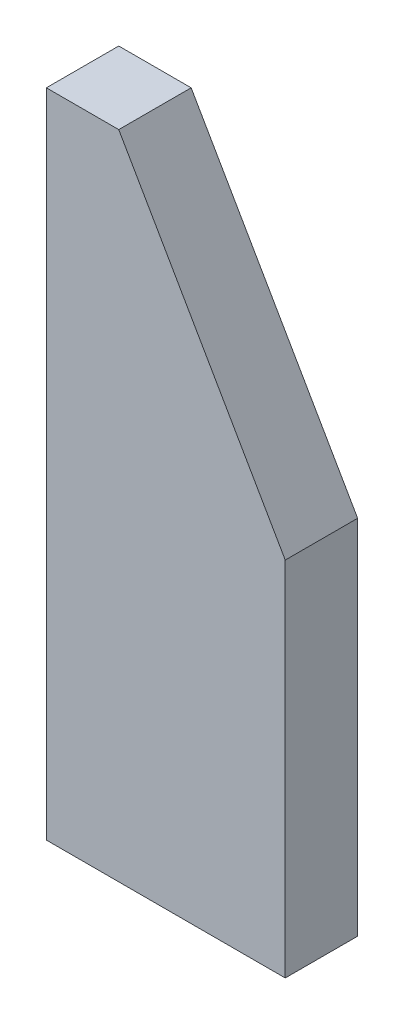
ISO-10303-21;
HEADER;
FILE_DESCRIPTION(('STEP AP214'),'2;1');
FILE_NAME('part.step','',(''),(''),'','','');
FILE_SCHEMA(('AUTOMOTIVE_DESIGN { 1 0 10303 214 1 1 1 1 }'));
ENDSEC;
DATA;
#1=APPLICATION_CONTEXT('core data for automotive mechanical design processes');
#2=APPLICATION_PROTOCOL_DEFINITION('international standard','automotive_design',2000,#1);
#3=PRODUCT_CONTEXT('',#1,'mechanical');
#4=PRODUCT('Part','Part','',(#3));
#5=PRODUCT_RELATED_PRODUCT_CATEGORY('part','',(#4));
#6=PRODUCT_DEFINITION_FORMATION('','',#4);
#7=PRODUCT_DEFINITION_CONTEXT('part definition',#1,'design');
#8=PRODUCT_DEFINITION('design','',#6,#7);
#9=PRODUCT_DEFINITION_SHAPE('','',#8);
#10=(LENGTH_UNIT() NAMED_UNIT(*) SI_UNIT(.MILLI.,.METRE.));
#11=(NAMED_UNIT(*) PLANE_ANGLE_UNIT() SI_UNIT($,.RADIAN.));
#12=(NAMED_UNIT(*) SI_UNIT($,.STERADIAN.) SOLID_ANGLE_UNIT());
#13=UNCERTAINTY_MEASURE_WITH_UNIT(LENGTH_MEASURE(1.E-05),#10,'distance_accuracy_value','');
#14=(GEOMETRIC_REPRESENTATION_CONTEXT(3) GLOBAL_UNCERTAINTY_ASSIGNED_CONTEXT((#13)) GLOBAL_UNIT_ASSIGNED_CONTEXT((#10,
#11,#12)) REPRESENTATION_CONTEXT('',''));
#15=CARTESIAN_POINT('',(0.,0.,0.));
#16=DIRECTION('',(0.,0.,1.));
#17=DIRECTION('',(1.,0.,0.));
#18=AXIS2_PLACEMENT_3D('',#15,#16,#17);
#19=CARTESIAN_POINT('',(0.,180.,20.));
#20=DIRECTION('',(1.,0.,0.));
#21=DIRECTION('',(0.,1.,0.));
#22=AXIS2_PLACEMENT_3D('',#19,#20,#21);
#23=PLANE('',#22);
#24=DIRECTION('',(0.,-1.,0.));
#25=VECTOR('',#24,1.);
#26=CARTESIAN_POINT('',(0.,180.,0.));
#27=LINE('',#26,#25);
#28=CARTESIAN_POINT('',(0.,180.,0.));
#29=VERTEX_POINT('',#28);
#30=CARTESIAN_POINT('',(0.,0.,0.));
#31=VERTEX_POINT('',#30);
#32=EDGE_CURVE('E109',#29,#31,#27,.T.);
#33=ORIENTED_EDGE('',*,*,#32,.T.);
#34=DIRECTION('',(0.,0.,-1.));
#35=VECTOR('',#34,1.);
#36=CARTESIAN_POINT('',(0.,0.,20.));
#37=LINE('',#36,#35);
#38=CARTESIAN_POINT('',(0.,0.,20.));
#39=VERTEX_POINT('',#38);
#40=EDGE_CURVE('E11',#39,#31,#37,.T.);
#41=ORIENTED_EDGE('',*,*,#40,.F.);
#42=DIRECTION('',(0.,-1.,0.));
#43=VECTOR('',#42,1.);
#44=CARTESIAN_POINT('',(0.,180.,20.));
#45=LINE('',#44,#43);
#46=CARTESIAN_POINT('',(0.,180.,20.));
#47=VERTEX_POINT('',#46);
#48=EDGE_CURVE('E117',#47,#39,#45,.T.);
#49=ORIENTED_EDGE('',*,*,#48,.F.);
#50=DIRECTION('',(0.,0.,-1.));
#51=VECTOR('',#50,1.);
#52=CARTESIAN_POINT('',(0.,180.,20.));
#53=LINE('',#52,#51);
#54=EDGE_CURVE('E105',#47,#29,#53,.T.);
#55=ORIENTED_EDGE('',*,*,#54,.T.);
#56=EDGE_LOOP('',(#33,#41,#49,#55));
#57=FACE_BOUND('',#56,.T.);
#58=ADVANCED_FACE('F35',(#57),#23,.F.);
#59=CARTESIAN_POINT('',(0.,0.,20.));
#60=DIRECTION('',(0.,1.,0.));
#61=DIRECTION('',(0.,0.,1.));
#62=AXIS2_PLACEMENT_3D('',#59,#60,#61);
#63=PLANE('',#62);
#64=DIRECTION('',(1.,0.,0.));
#65=VECTOR('',#64,1.);
#66=CARTESIAN_POINT('',(0.,0.,0.));
#67=LINE('',#66,#65);
#68=CARTESIAN_POINT('',(66.,0.,0.));
#69=VERTEX_POINT('',#68);
#70=EDGE_CURVE('E112',#31,#69,#67,.T.);
#71=ORIENTED_EDGE('',*,*,#70,.T.);
#72=DIRECTION('',(0.,0.,-1.));
#73=VECTOR('',#72,1.);
#74=CARTESIAN_POINT('',(66.,0.,20.));
#75=LINE('',#74,#73);
#76=CARTESIAN_POINT('',(66.,0.,20.));
#77=VERTEX_POINT('',#76);
#78=EDGE_CURVE('E43',#77,#69,#75,.T.);
#79=ORIENTED_EDGE('',*,*,#78,.F.);
#80=DIRECTION('',(1.,0.,0.));
#81=VECTOR('',#80,1.);
#82=CARTESIAN_POINT('',(0.,0.,20.));
#83=LINE('',#82,#81);
#84=EDGE_CURVE('E85',#39,#77,#83,.T.);
#85=ORIENTED_EDGE('',*,*,#84,.F.);
#86=ORIENTED_EDGE('',*,*,#40,.T.);
#87=EDGE_LOOP('',(#71,#79,#85,#86));
#88=FACE_BOUND('',#87,.T.);
#89=ADVANCED_FACE('F136',(#88),#63,.F.);
#90=CARTESIAN_POINT('',(66.,0.,20.));
#91=DIRECTION('',(-1.,0.,0.));
#92=DIRECTION('',(0.,0.,1.));
#93=AXIS2_PLACEMENT_3D('',#90,#91,#92);
#94=PLANE('',#93);
#95=DIRECTION('',(0.,1.,0.));
#96=VECTOR('',#95,1.);
#97=CARTESIAN_POINT('',(66.,0.,0.));
#98=LINE('',#97,#96);
#99=CARTESIAN_POINT('',(66.,100.,0.));
#100=VERTEX_POINT('',#99);
#101=EDGE_CURVE('E100',#69,#100,#98,.T.);
#102=ORIENTED_EDGE('',*,*,#101,.T.);
#103=DIRECTION('',(0.,0.,-1.));
#104=VECTOR('',#103,1.);
#105=CARTESIAN_POINT('',(66.,100.,20.));
#106=LINE('',#105,#104);
#107=CARTESIAN_POINT('',(66.,100.,20.));
#108=VERTEX_POINT('',#107);
#109=EDGE_CURVE('E97',#108,#100,#106,.T.);
#110=ORIENTED_EDGE('',*,*,#109,.F.);
#111=DIRECTION('',(0.,1.,0.));
#112=VECTOR('',#111,1.);
#113=CARTESIAN_POINT('',(66.,0.,20.));
#114=LINE('',#113,#112);
#115=EDGE_CURVE('E89',#77,#108,#114,.T.);
#116=ORIENTED_EDGE('',*,*,#115,.F.);
#117=ORIENTED_EDGE('',*,*,#78,.T.);
#118=EDGE_LOOP('',(#102,#110,#116,#117));
#119=FACE_BOUND('',#118,.T.);
#120=ADVANCED_FACE('F98',(#119),#94,.F.);
#121=CARTESIAN_POINT('',(66.,100.,20.));
#122=DIRECTION('',(-0.866906303057535,-0.498471124258083,0.));
#123=DIRECTION('',(0.498471124258083,-0.866906303057535,0.));
#124=AXIS2_PLACEMENT_3D('',#121,#122,#123);
#125=PLANE('',#124);
#126=DIRECTION('',(-0.498471124258083,0.866906303057535,0.));
#127=VECTOR('',#126,1.);
#128=CARTESIAN_POINT('',(66.,100.,0.));
#129=LINE('',#128,#127);
#130=CARTESIAN_POINT('',(20.,180.,0.));
#131=VERTEX_POINT('',#130);
#132=EDGE_CURVE('E71',#100,#131,#129,.T.);
#133=ORIENTED_EDGE('',*,*,#132,.T.);
#134=DIRECTION('',(0.,0.,-1.));
#135=VECTOR('',#134,1.);
#136=CARTESIAN_POINT('',(20.,180.,20.));
#137=LINE('',#136,#135);
#138=CARTESIAN_POINT('',(20.,180.,20.));
#139=VERTEX_POINT('',#138);
#140=EDGE_CURVE('E101',#139,#131,#137,.T.);
#141=ORIENTED_EDGE('',*,*,#140,.F.);
#142=DIRECTION('',(-0.498471124258083,0.866906303057535,0.));
#143=VECTOR('',#142,1.);
#144=CARTESIAN_POINT('',(66.,100.,20.));
#145=LINE('',#144,#143);
#146=EDGE_CURVE('E93',#108,#139,#145,.T.);
#147=ORIENTED_EDGE('',*,*,#146,.F.);
#148=ORIENTED_EDGE('',*,*,#109,.T.);
#149=EDGE_LOOP('',(#133,#141,#147,#148));
#150=FACE_BOUND('',#149,.T.);
#151=ADVANCED_FACE('F103',(#150),#125,.F.);
#152=CARTESIAN_POINT('',(20.,180.,20.));
#153=DIRECTION('',(0.,-1.,0.));
#154=DIRECTION('',(0.,0.,-1.));
#155=AXIS2_PLACEMENT_3D('',#152,#153,#154);
#156=PLANE('',#155);
#157=DIRECTION('',(-1.,0.,0.));
#158=VECTOR('',#157,1.);
#159=CARTESIAN_POINT('',(20.,180.,0.));
#160=LINE('',#159,#158);
#161=EDGE_CURVE('E77',#131,#29,#160,.T.);
#162=ORIENTED_EDGE('',*,*,#161,.T.);
#163=ORIENTED_EDGE('',*,*,#54,.F.);
#164=DIRECTION('',(-1.,0.,0.));
#165=VECTOR('',#164,1.);
#166=CARTESIAN_POINT('',(20.,180.,20.));
#167=LINE('',#166,#165);
#168=EDGE_CURVE('E51',#139,#47,#167,.T.);
#169=ORIENTED_EDGE('',*,*,#168,.F.);
#170=ORIENTED_EDGE('',*,*,#140,.T.);
#171=EDGE_LOOP('',(#162,#163,#169,#170));
#172=FACE_BOUND('',#171,.T.);
#173=ADVANCED_FACE('F125',(#172),#156,.F.);
#174=CARTESIAN_POINT('',(0.,0.,20.));
#175=DIRECTION('',(0.,0.,1.));
#176=DIRECTION('',(1.,0.,0.));
#177=AXIS2_PLACEMENT_3D('',#174,#175,#176);
#178=PLANE('',#177);
#179=ORIENTED_EDGE('',*,*,#48,.T.);
#180=ORIENTED_EDGE('',*,*,#84,.T.);
#181=ORIENTED_EDGE('',*,*,#115,.T.);
#182=ORIENTED_EDGE('',*,*,#146,.T.);
#183=ORIENTED_EDGE('',*,*,#168,.T.);
#184=EDGE_LOOP('',(#179,#180,#181,#182,#183));
#185=FACE_BOUND('',#184,.T.);
#186=ADVANCED_FACE('F91',(#185),#178,.T.);
#187=CARTESIAN_POINT('',(0.,0.,0.));
#188=DIRECTION('',(0.,0.,1.));
#189=DIRECTION('',(1.,0.,0.));
#190=AXIS2_PLACEMENT_3D('',#187,#188,#189);
#191=PLANE('',#190);
#192=ORIENTED_EDGE('',*,*,#32,.F.);
#193=ORIENTED_EDGE('',*,*,#161,.F.);
#194=ORIENTED_EDGE('',*,*,#132,.F.);
#195=ORIENTED_EDGE('',*,*,#101,.F.);
#196=ORIENTED_EDGE('',*,*,#70,.F.);
#197=EDGE_LOOP('',(#192,#193,#194,#195,#196));
#198=FACE_BOUND('',#197,.T.);
#199=ADVANCED_FACE('F121',(#198),#191,.F.);
#200=CLOSED_SHELL('',(#58,#89,#120,#151,#173,#186,#199));
#201=MANIFOLD_SOLID_BREP('B2',#200);
#202=ADVANCED_BREP_SHAPE_REPRESENTATION('',(#18,#201),#14);
#203=SHAPE_DEFINITION_REPRESENTATION(#9,#202);
ENDSEC;
END-ISO-10303-21;
